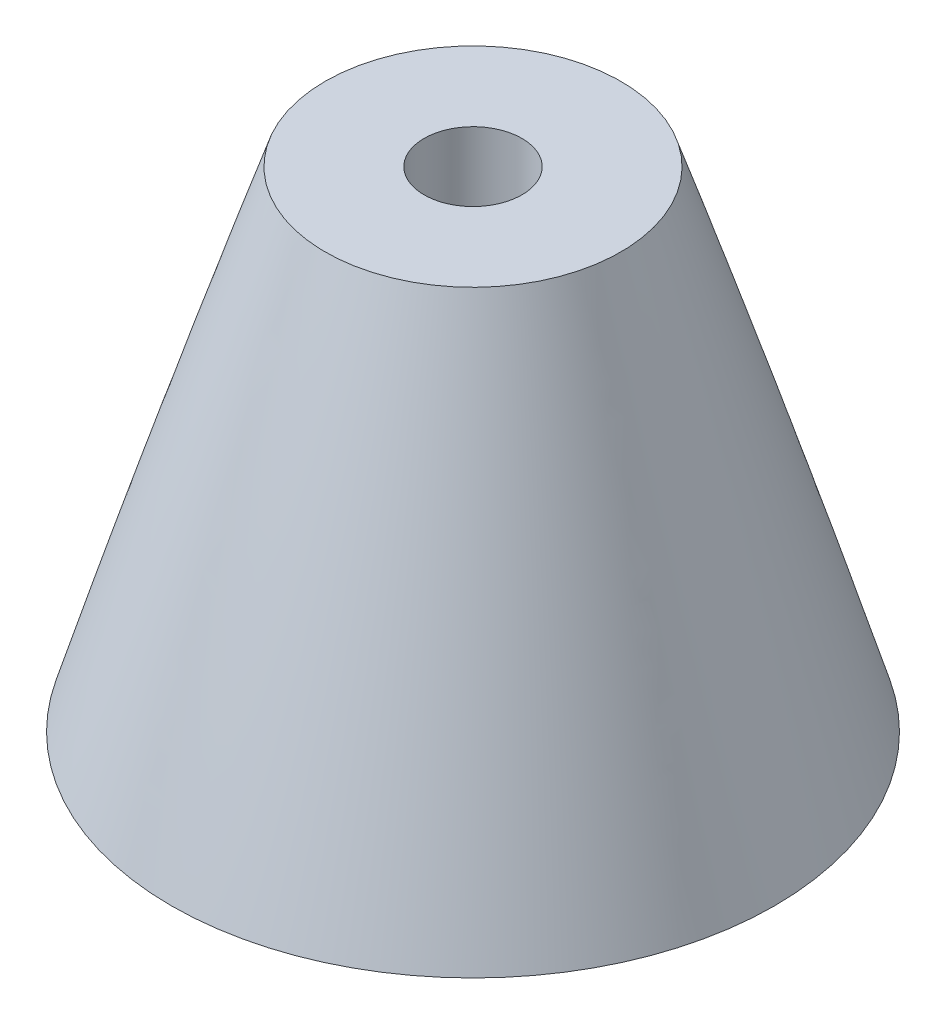
ISO-10303-21;
HEADER;
FILE_DESCRIPTION(('STEP AP214'),'2;1');
FILE_NAME('part.step','',(''),(''),'','','');
FILE_SCHEMA(('AUTOMOTIVE_DESIGN { 1 0 10303 214 1 1 1 1 }'));
ENDSEC;
DATA;
#1=APPLICATION_CONTEXT('core data for automotive mechanical design processes');
#2=APPLICATION_PROTOCOL_DEFINITION('international standard','automotive_design',2000,#1);
#3=PRODUCT_CONTEXT('',#1,'mechanical');
#4=PRODUCT('Part','Part','',(#3));
#5=PRODUCT_RELATED_PRODUCT_CATEGORY('part','',(#4));
#6=PRODUCT_DEFINITION_FORMATION('','',#4);
#7=PRODUCT_DEFINITION_CONTEXT('part definition',#1,'design');
#8=PRODUCT_DEFINITION('design','',#6,#7);
#9=PRODUCT_DEFINITION_SHAPE('','',#8);
#10=(LENGTH_UNIT() NAMED_UNIT(*) SI_UNIT(.MILLI.,.METRE.));
#11=(NAMED_UNIT(*) PLANE_ANGLE_UNIT() SI_UNIT($,.RADIAN.));
#12=(NAMED_UNIT(*) SI_UNIT($,.STERADIAN.) SOLID_ANGLE_UNIT());
#13=UNCERTAINTY_MEASURE_WITH_UNIT(LENGTH_MEASURE(1.E-05),#10,'distance_accuracy_value','');
#14=(GEOMETRIC_REPRESENTATION_CONTEXT(3) GLOBAL_UNCERTAINTY_ASSIGNED_CONTEXT((#13)) GLOBAL_UNIT_ASSIGNED_CONTEXT((#10,
#11,#12)) REPRESENTATION_CONTEXT('',''));
#15=CARTESIAN_POINT('',(0.,0.,0.));
#16=DIRECTION('',(0.,0.,1.));
#17=DIRECTION('',(1.,0.,0.));
#18=AXIS2_PLACEMENT_3D('',#15,#16,#17);
#19=CARTESIAN_POINT('',(0.,292.1,0.));
#20=DIRECTION('',(0.,1.,0.));
#21=DIRECTION('',(0.,0.,1.));
#22=AXIS2_PLACEMENT_3D('',#19,#20,#21);
#23=PLANE('',#22);
#24=CARTESIAN_POINT('',(0.,292.1,0.));
#25=DIRECTION('',(0.,-1.,0.));
#26=DIRECTION('',(0.,0.,-1.));
#27=AXIS2_PLACEMENT_3D('',#24,#25,#26);
#28=CIRCLE('',#27,3.81);
#29=CARTESIAN_POINT('',(0.,292.1,-3.81));
#30=VERTEX_POINT('',#29);
#31=EDGE_CURVE('E56',#30,#30,#28,.T.);
#32=ORIENTED_EDGE('',*,*,#31,.T.);
#33=EDGE_LOOP('',(#32));
#34=FACE_BOUND('',#33,.T.);
#35=CARTESIAN_POINT('',(2.25514051876985E-13,292.1,0.));
#36=DIRECTION('',(0.,1.,0.));
#37=DIRECTION('',(-1.,0.,0.));
#38=AXIS2_PLACEMENT_3D('',#35,#36,#37);
#39=CIRCLE('',#38,11.5085819285119);
#40=CARTESIAN_POINT('',(-11.5085819285117,292.1,0.));
#41=VERTEX_POINT('',#40);
#42=EDGE_CURVE('E62',#41,#41,#39,.T.);
#43=ORIENTED_EDGE('',*,*,#42,.T.);
#44=EDGE_LOOP('',(#43));
#45=FACE_BOUND('',#44,.T.);
#46=ADVANCED_FACE('F39',(#34,#45),#23,.T.);
#47=CARTESIAN_POINT('',(0.,0.,0.));
#48=DIRECTION('',(0.,-1.,0.));
#49=DIRECTION('',(0.,0.,-1.));
#50=AXIS2_PLACEMENT_3D('',#47,#48,#49);
#51=CYLINDRICAL_SURFACE('',#50,3.81);
#52=ORIENTED_EDGE('',*,*,#31,.F.);
#53=EDGE_LOOP('',(#52));
#54=FACE_BOUND('',#53,.T.);
#55=CARTESIAN_POINT('',(0.,285.75,0.));
#56=DIRECTION('',(0.,-1.,0.));
#57=DIRECTION('',(0.,0.,-1.));
#58=AXIS2_PLACEMENT_3D('',#55,#56,#57);
#59=CIRCLE('',#58,3.81);
#60=CARTESIAN_POINT('',(0.,285.75,-3.81));
#61=VERTEX_POINT('',#60);
#62=EDGE_CURVE('E10',#61,#61,#59,.T.);
#63=ORIENTED_EDGE('',*,*,#62,.T.);
#64=EDGE_LOOP('',(#63));
#65=FACE_BOUND('',#64,.T.);
#66=ADVANCED_FACE('F91',(#54,#65),#51,.F.);
#67=CARTESIAN_POINT('',(-10.24674841812,285.75,0.));
#68=DIRECTION('',(0.,1.,0.));
#69=DIRECTION('',(0.,0.,1.));
#70=AXIS2_PLACEMENT_3D('',#67,#68,#69);
#71=PLANE('',#70);
#72=ORIENTED_EDGE('',*,*,#62,.F.);
#73=EDGE_LOOP('',(#72));
#74=FACE_BOUND('',#73,.T.);
#75=CARTESIAN_POINT('',(0.,285.75,0.));
#76=DIRECTION('',(0.,-1.,0.));
#77=DIRECTION('',(0.,0.,-1.));
#78=AXIS2_PLACEMENT_3D('',#75,#76,#77);
#79=CIRCLE('',#78,10.24674841812);
#80=CARTESIAN_POINT('',(0.,285.75,-10.24674841812));
#81=VERTEX_POINT('',#80);
#82=EDGE_CURVE('E46',#81,#81,#79,.T.);
#83=ORIENTED_EDGE('',*,*,#82,.T.);
#84=EDGE_LOOP('',(#83));
#85=FACE_BOUND('',#84,.T.);
#86=ADVANCED_FACE('F88',(#74,#85),#71,.F.);
#87=CARTESIAN_POINT('',(0.,260.852181245839,0.));
#88=DIRECTION('',(0.,-1.,0.));
#89=DIRECTION('',(0.,0.,-1.));
#90=AXIS2_PLACEMENT_3D('',#87,#88,#89);
#91=CONICAL_SURFACE('',#90,17.6116588662448,0.287604153577873);
#92=ORIENTED_EDGE('',*,*,#82,.F.);
#93=EDGE_LOOP('',(#92));
#94=FACE_BOUND('',#93,.T.);
#95=CARTESIAN_POINT('',(0.,260.852181245839,0.));
#96=DIRECTION('',(0.,-1.,0.));
#97=DIRECTION('',(0.,0.,-1.));
#98=AXIS2_PLACEMENT_3D('',#95,#96,#97);
#99=CIRCLE('',#98,17.6116588662448);
#100=CARTESIAN_POINT('',(0.,260.852181245839,-17.6116588662448));
#101=VERTEX_POINT('',#100);
#102=EDGE_CURVE('E51',#101,#101,#99,.T.);
#103=ORIENTED_EDGE('',*,*,#102,.T.);
#104=EDGE_LOOP('',(#103));
#105=FACE_BOUND('',#104,.T.);
#106=ADVANCED_FACE('F84',(#94,#105),#91,.F.);
#107=CARTESIAN_POINT('',(0.,254.,0.));
#108=DIRECTION('',(0.,-1.,0.));
#109=DIRECTION('',(0.,0.,-1.));
#110=AXIS2_PLACEMENT_3D('',#107,#108,#109);
#111=CONICAL_SURFACE('',#110,23.4752814513255,0.707811698408335);
#112=ORIENTED_EDGE('',*,*,#102,.F.);
#113=EDGE_LOOP('',(#112));
#114=FACE_BOUND('',#113,.T.);
#115=CARTESIAN_POINT('',(0.,254.,0.));
#116=DIRECTION('',(0.,1.,0.));
#117=DIRECTION('',(-1.,0.,0.));
#118=AXIS2_PLACEMENT_3D('',#115,#116,#117);
#119=CIRCLE('',#118,23.4752814513255);
#120=CARTESIAN_POINT('',(-23.4752814513255,254.,0.));
#121=VERTEX_POINT('',#120);
#122=EDGE_CURVE('E66',#121,#121,#119,.T.);
#123=ORIENTED_EDGE('',*,*,#122,.F.);
#124=EDGE_LOOP('',(#123));
#125=FACE_BOUND('',#124,.T.);
#126=ADVANCED_FACE('F80',(#114,#125),#111,.F.);
#127=CARTESIAN_POINT('',(-23.4752814513255,254.,0.));
#128=CARTESIAN_POINT('',(-17.8072102348916,273.148920025782,0.));
#129=CARTESIAN_POINT('',(-11.5085819285117,292.1,0.));
#130=B_SPLINE_CURVE_WITH_KNOTS('',2,(#127,#128,#129),.UNSPECIFIED.,.F.,.F.,(3,3),(0.,1.),.UNSPECIFIED.);
#131=CARTESIAN_POINT('',(2.25514051876985E-13,292.1,0.));
#132=DIRECTION('',(0.,1.,0.));
#133=AXIS1_PLACEMENT('',#131,#132);
#134=SURFACE_OF_REVOLUTION('',#130,#133);
#135=ORIENTED_EDGE('',*,*,#42,.F.);
#136=EDGE_LOOP('',(#135));
#137=FACE_BOUND('',#136,.T.);
#138=ORIENTED_EDGE('',*,*,#122,.T.);
#139=EDGE_LOOP('',(#138));
#140=FACE_BOUND('',#139,.T.);
#141=ADVANCED_FACE('F77',(#137,#140),#134,.T.);
#142=CLOSED_SHELL('',(#46,#66,#86,#106,#126,#141));
#143=MANIFOLD_SOLID_BREP('B2',#142);
#144=ADVANCED_BREP_SHAPE_REPRESENTATION('',(#18,#143),#14);
#145=SHAPE_DEFINITION_REPRESENTATION(#9,#144);
ENDSEC;
END-ISO-10303-21;
